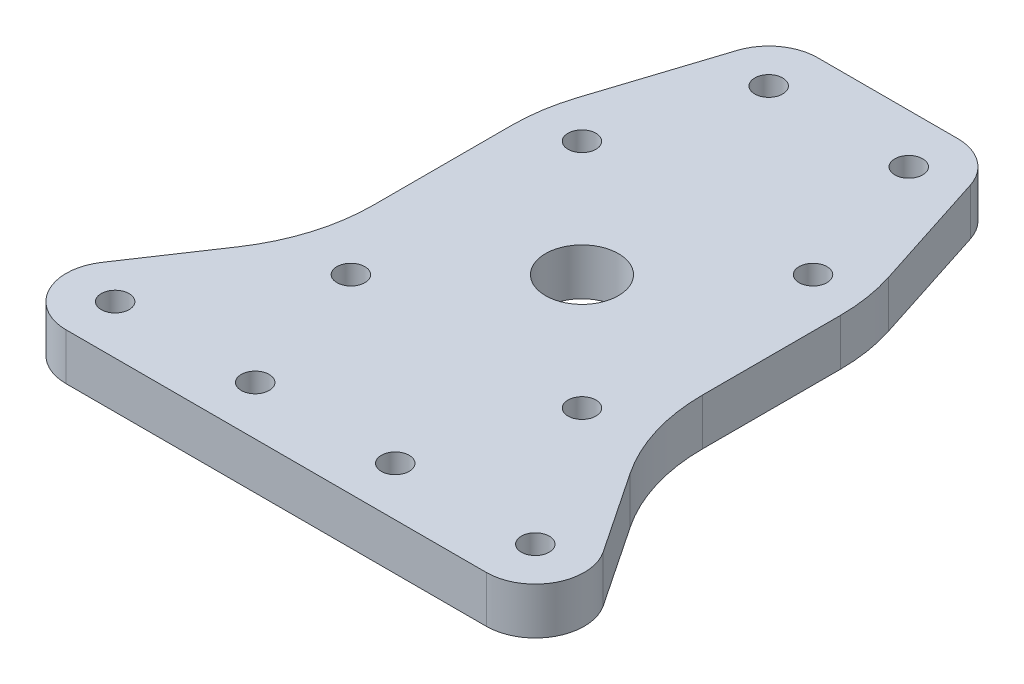
ISO-10303-21;
HEADER;
FILE_DESCRIPTION(('STEP AP214'),'2;1');
FILE_NAME('part.step','',(''),(''),'','','');
FILE_SCHEMA(('AUTOMOTIVE_DESIGN { 1 0 10303 214 1 1 1 1 }'));
ENDSEC;
DATA;
#1=APPLICATION_CONTEXT('core data for automotive mechanical design processes');
#2=APPLICATION_PROTOCOL_DEFINITION('international standard','automotive_design',2000,#1);
#3=PRODUCT_CONTEXT('',#1,'mechanical');
#4=PRODUCT('Part','Part','',(#3));
#5=PRODUCT_RELATED_PRODUCT_CATEGORY('part','',(#4));
#6=PRODUCT_DEFINITION_FORMATION('','',#4);
#7=PRODUCT_DEFINITION_CONTEXT('part definition',#1,'design');
#8=PRODUCT_DEFINITION('design','',#6,#7);
#9=PRODUCT_DEFINITION_SHAPE('','',#8);
#10=(LENGTH_UNIT() NAMED_UNIT(*) SI_UNIT(.MILLI.,.METRE.));
#11=(NAMED_UNIT(*) PLANE_ANGLE_UNIT() SI_UNIT($,.RADIAN.));
#12=(NAMED_UNIT(*) SI_UNIT($,.STERADIAN.) SOLID_ANGLE_UNIT());
#13=UNCERTAINTY_MEASURE_WITH_UNIT(LENGTH_MEASURE(1.E-05),#10,'distance_accuracy_value','');
#14=(GEOMETRIC_REPRESENTATION_CONTEXT(3) GLOBAL_UNCERTAINTY_ASSIGNED_CONTEXT((#13)) GLOBAL_UNIT_ASSIGNED_CONTEXT((#10,
#11,#12)) REPRESENTATION_CONTEXT('',''));
#15=CARTESIAN_POINT('',(0.,0.,0.));
#16=DIRECTION('',(0.,0.,1.));
#17=DIRECTION('',(1.,0.,0.));
#18=AXIS2_PLACEMENT_3D('',#15,#16,#17);
#19=CARTESIAN_POINT('',(0.,0.,0.));
#20=DIRECTION('',(0.,-1.,0.));
#21=DIRECTION('',(0.,0.,-1.));
#22=AXIS2_PLACEMENT_3D('',#19,#20,#21);
#23=PLANE('',#22);
#24=CARTESIAN_POINT('',(-15.7154482118709,0.,-60.1654482118711));
#25=DIRECTION('',(0.,1.,0.));
#26=DIRECTION('',(0.,0.,1.));
#27=AXIS2_PLACEMENT_3D('',#24,#25,#26);
#28=CIRCLE('',#27,1.89865);
#29=CARTESIAN_POINT('',(-15.7154482118709,0.,-58.2667982118711));
#30=VERTEX_POINT('',#29);
#31=EDGE_CURVE('E228',#30,#30,#28,.T.);
#32=ORIENTED_EDGE('',*,*,#31,.F.);
#33=EDGE_LOOP('',(#32));
#34=FACE_BOUND('',#33,.T.);
#35=CARTESIAN_POINT('',(15.7154482118709,0.,-28.7345517881289));
#36=DIRECTION('',(0.,1.,0.));
#37=DIRECTION('',(0.,0.,1.));
#38=AXIS2_PLACEMENT_3D('',#35,#36,#37);
#39=CIRCLE('',#38,1.89865);
#40=CARTESIAN_POINT('',(15.7154482118709,0.,-26.8359017881289));
#41=VERTEX_POINT('',#40);
#42=EDGE_CURVE('E246',#41,#41,#39,.T.);
#43=ORIENTED_EDGE('',*,*,#42,.F.);
#44=EDGE_LOOP('',(#43));
#45=FACE_BOUND('',#44,.T.);
#46=CARTESIAN_POINT('',(-15.7154482118712,0.,-28.7345517881291));
#47=DIRECTION('',(0.,1.,0.));
#48=DIRECTION('',(0.,0.,1.));
#49=AXIS2_PLACEMENT_3D('',#46,#47,#48);
#50=CIRCLE('',#49,1.89865);
#51=CARTESIAN_POINT('',(-15.7154482118712,0.,-26.8359017881291));
#52=VERTEX_POINT('',#51);
#53=EDGE_CURVE('E252',#52,#52,#50,.T.);
#54=ORIENTED_EDGE('',*,*,#53,.F.);
#55=EDGE_LOOP('',(#54));
#56=FACE_BOUND('',#55,.T.);
#57=CARTESIAN_POINT('',(-9.525,0.,-9.525));
#58=DIRECTION('',(0.,1.,0.));
#59=DIRECTION('',(0.,0.,1.));
#60=AXIS2_PLACEMENT_3D('',#57,#58,#59);
#61=CIRCLE('',#60,1.89864999999999);
#62=CARTESIAN_POINT('',(-9.525,0.,-7.62635000000001));
#63=VERTEX_POINT('',#62);
#64=EDGE_CURVE('E300',#63,#63,#61,.T.);
#65=ORIENTED_EDGE('',*,*,#64,.F.);
#66=EDGE_LOOP('',(#65));
#67=FACE_BOUND('',#66,.T.);
#68=CARTESIAN_POINT('',(-28.575,0.,-9.525));
#69=DIRECTION('',(0.,1.,0.));
#70=DIRECTION('',(0.,0.,1.));
#71=AXIS2_PLACEMENT_3D('',#68,#69,#70);
#72=CIRCLE('',#71,1.89864999999999);
#73=CARTESIAN_POINT('',(-28.575,0.,-7.62635000000001));
#74=VERTEX_POINT('',#73);
#75=EDGE_CURVE('E294',#74,#74,#72,.T.);
#76=ORIENTED_EDGE('',*,*,#75,.F.);
#77=EDGE_LOOP('',(#76));
#78=FACE_BOUND('',#77,.T.);
#79=CARTESIAN_POINT('',(9.525,0.,-79.375));
#80=DIRECTION('',(0.,1.,0.));
#81=DIRECTION('',(0.,0.,1.));
#82=AXIS2_PLACEMENT_3D('',#79,#80,#81);
#83=CIRCLE('',#82,1.89864999999999);
#84=CARTESIAN_POINT('',(9.525,0.,-77.47635));
#85=VERTEX_POINT('',#84);
#86=EDGE_CURVE('E288',#85,#85,#83,.T.);
#87=ORIENTED_EDGE('',*,*,#86,.F.);
#88=EDGE_LOOP('',(#87));
#89=FACE_BOUND('',#88,.T.);
#90=CARTESIAN_POINT('',(-9.525,0.,-79.375));
#91=DIRECTION('',(0.,1.,0.));
#92=DIRECTION('',(0.,0.,1.));
#93=AXIS2_PLACEMENT_3D('',#90,#91,#92);
#94=CIRCLE('',#93,1.89864999999999);
#95=CARTESIAN_POINT('',(-9.525,0.,-77.47635));
#96=VERTEX_POINT('',#95);
#97=EDGE_CURVE('E282',#96,#96,#94,.T.);
#98=ORIENTED_EDGE('',*,*,#97,.F.);
#99=EDGE_LOOP('',(#98));
#100=FACE_BOUND('',#99,.T.);
#101=CARTESIAN_POINT('',(9.525,0.,-9.525));
#102=DIRECTION('',(0.,1.,0.));
#103=DIRECTION('',(0.,0.,1.));
#104=AXIS2_PLACEMENT_3D('',#101,#102,#103);
#105=CIRCLE('',#104,1.89864999999999);
#106=CARTESIAN_POINT('',(9.525,0.,-7.62635000000001));
#107=VERTEX_POINT('',#106);
#108=EDGE_CURVE('E276',#107,#107,#105,.T.);
#109=ORIENTED_EDGE('',*,*,#108,.F.);
#110=EDGE_LOOP('',(#109));
#111=FACE_BOUND('',#110,.T.);
#112=CARTESIAN_POINT('',(28.575,0.,-9.525));
#113=DIRECTION('',(0.,1.,0.));
#114=DIRECTION('',(0.,0.,1.));
#115=AXIS2_PLACEMENT_3D('',#112,#113,#114);
#116=CIRCLE('',#115,1.89864999999999);
#117=CARTESIAN_POINT('',(28.575,0.,-7.62635000000001));
#118=VERTEX_POINT('',#117);
#119=EDGE_CURVE('E270',#118,#118,#116,.T.);
#120=ORIENTED_EDGE('',*,*,#119,.F.);
#121=EDGE_LOOP('',(#120));
#122=FACE_BOUND('',#121,.T.);
#123=CARTESIAN_POINT('',(0.,0.,-44.45));
#124=DIRECTION('',(0.,1.,0.));
#125=DIRECTION('',(0.,0.,1.));
#126=AXIS2_PLACEMENT_3D('',#123,#124,#125);
#127=CIRCLE('',#126,4.96062);
#128=CARTESIAN_POINT('',(0.,0.,-39.48938));
#129=VERTEX_POINT('',#128);
#130=EDGE_CURVE('E264',#129,#129,#127,.T.);
#131=ORIENTED_EDGE('',*,*,#130,.F.);
#132=EDGE_LOOP('',(#131));
#133=FACE_BOUND('',#132,.T.);
#134=CARTESIAN_POINT('',(15.7154482118712,0.,-60.1654482118709));
#135=DIRECTION('',(0.,1.,0.));
#136=DIRECTION('',(0.,0.,1.));
#137=AXIS2_PLACEMENT_3D('',#134,#135,#136);
#138=CIRCLE('',#137,1.89865);
#139=CARTESIAN_POINT('',(15.7154482118712,0.,-58.2667982118709));
#140=VERTEX_POINT('',#139);
#141=EDGE_CURVE('E258',#140,#140,#138,.T.);
#142=ORIENTED_EDGE('',*,*,#141,.F.);
#143=EDGE_LOOP('',(#142));
#144=FACE_BOUND('',#143,.T.);
#145=DIRECTION('',(-0.306725356798658,0.,0.951798064453136));
#146=VECTOR('',#145,1.);
#147=CARTESIAN_POINT('',(-38.1417386411364,0.,-12.2915131166457));
#148=LINE('',#147,#146);
#149=CARTESIAN_POINT('',(-15.865069677032,0.,-81.4181436104394));
#150=VERTEX_POINT('',#149);
#151=CARTESIAN_POINT('',(-21.1522690489806,0.,-65.0114592035097));
#152=VERTEX_POINT('',#151);
#153=EDGE_CURVE('E210',#150,#152,#148,.T.);
#154=ORIENTED_EDGE('',*,*,#153,.T.);
#155=CARTESIAN_POINT('',(3.02340178812909,0.,-57.2206351408238));
#156=DIRECTION('',(0.,-1.,0.));
#157=DIRECTION('',(0.,0.,-1.));
#158=AXIS2_PLACEMENT_3D('',#155,#156,#157);
#159=CIRCLE('',#158,25.4);
#160=CARTESIAN_POINT('',(-22.3765982118709,0.,-57.2206351408238));
#161=VERTEX_POINT('',#160);
#162=EDGE_CURVE('E311',#152,#161,#159,.F.);
#163=ORIENTED_EDGE('',*,*,#162,.T.);
#164=DIRECTION('',(0.,0.,1.));
#165=VECTOR('',#164,1.);
#166=CARTESIAN_POINT('',(-22.3765982118709,0.,0.));
#167=LINE('',#166,#165);
#168=CARTESIAN_POINT('',(-22.3765982118709,0.,-38.4753969646792));
#169=VERTEX_POINT('',#168);
#170=EDGE_CURVE('E207',#161,#169,#167,.T.);
#171=ORIENTED_EDGE('',*,*,#170,.T.);
#172=CARTESIAN_POINT('',(-47.7765982118709,0.,-38.4753969646792));
#173=DIRECTION('',(0.,-1.,0.));
#174=DIRECTION('',(0.,0.,-1.));
#175=AXIS2_PLACEMENT_3D('',#172,#173,#174);
#176=CIRCLE('',#175,25.4);
#177=CARTESIAN_POINT('',(-26.6695305790557,0.,-24.3455811150736));
#178=VERTEX_POINT('',#177);
#179=EDGE_CURVE('E42',#169,#178,#176,.T.);
#180=ORIENTED_EDGE('',*,*,#179,.T.);
#181=DIRECTION('',(-0.556291962582896,0.,0.830986914677764));
#182=VECTOR('',#181,1.);
#183=CARTESIAN_POINT('',(-29.6706221522406,0.,-19.8625614153333));
#184=LINE('',#183,#182);
#185=CARTESIAN_POINT('',(-34.1103284867058,0.,-13.2305442065591));
#186=VERTEX_POINT('',#185);
#187=EDGE_CURVE('E205',#178,#186,#184,.T.);
#188=ORIENTED_EDGE('',*,*,#187,.T.);
#189=CARTESIAN_POINT('',(-28.575,0.,-9.525));
#190=DIRECTION('',(0.,1.,0.));
#191=DIRECTION('',(0.,0.,1.));
#192=AXIS2_PLACEMENT_3D('',#189,#190,#191);
#193=CIRCLE('',#192,6.66114999999999);
#194=CARTESIAN_POINT('',(-28.575,0.,-2.86385000000002));
#195=VERTEX_POINT('',#194);
#196=EDGE_CURVE('E202',#186,#195,#193,.T.);
#197=ORIENTED_EDGE('',*,*,#196,.T.);
#198=DIRECTION('',(1.,0.,0.));
#199=VECTOR('',#198,1.);
#200=CARTESIAN_POINT('',(0.,0.,-2.86385000000002));
#201=LINE('',#200,#199);
#202=CARTESIAN_POINT('',(28.575,0.,-2.86385000000002));
#203=VERTEX_POINT('',#202);
#204=EDGE_CURVE('E200',#195,#203,#201,.T.);
#205=ORIENTED_EDGE('',*,*,#204,.T.);
#206=CARTESIAN_POINT('',(28.575,0.,-9.525));
#207=DIRECTION('',(0.,1.,0.));
#208=DIRECTION('',(0.,0.,1.));
#209=AXIS2_PLACEMENT_3D('',#206,#207,#208);
#210=CIRCLE('',#209,6.66114999999999);
#211=CARTESIAN_POINT('',(34.1103284867058,0.,-13.2305442065591));
#212=VERTEX_POINT('',#211);
#213=EDGE_CURVE('E167',#203,#212,#210,.T.);
#214=ORIENTED_EDGE('',*,*,#213,.T.);
#215=DIRECTION('',(0.556291962582896,0.,0.830986914677764));
#216=VECTOR('',#215,1.);
#217=CARTESIAN_POINT('',(29.6706221522406,0.,-19.8625614153334));
#218=LINE('',#217,#216);
#219=CARTESIAN_POINT('',(26.6695305790559,0.,-24.3455811150733));
#220=VERTEX_POINT('',#219);
#221=EDGE_CURVE('E173',#220,#212,#218,.T.);
#222=ORIENTED_EDGE('',*,*,#221,.F.);
#223=CARTESIAN_POINT('',(47.7765982118712,0.,-38.4753969646789));
#224=DIRECTION('',(0.,-1.,0.));
#225=DIRECTION('',(0.,0.,-1.));
#226=AXIS2_PLACEMENT_3D('',#223,#224,#225);
#227=CIRCLE('',#226,25.4);
#228=CARTESIAN_POINT('',(22.3765982118712,0.,-38.4753969646789));
#229=VERTEX_POINT('',#228);
#230=EDGE_CURVE('E332',#220,#229,#227,.T.);
#231=ORIENTED_EDGE('',*,*,#230,.T.);
#232=DIRECTION('',(0.,0.,1.));
#233=VECTOR('',#232,1.);
#234=CARTESIAN_POINT('',(22.3765982118712,0.,0.));
#235=LINE('',#234,#233);
#236=CARTESIAN_POINT('',(22.3765982118711,0.,-57.2206351408231));
#237=VERTEX_POINT('',#236);
#238=EDGE_CURVE('E175',#237,#229,#235,.T.);
#239=ORIENTED_EDGE('',*,*,#238,.F.);
#240=CARTESIAN_POINT('',(-3.02340178812886,0.,-57.2206351408231));
#241=DIRECTION('',(0.,-1.,0.));
#242=DIRECTION('',(0.,0.,-1.));
#243=AXIS2_PLACEMENT_3D('',#240,#241,#242);
#244=CIRCLE('',#243,25.4);
#245=CARTESIAN_POINT('',(21.1522690489808,0.,-65.011459203509));
#246=VERTEX_POINT('',#245);
#247=EDGE_CURVE('E309',#237,#246,#244,.F.);
#248=ORIENTED_EDGE('',*,*,#247,.T.);
#249=DIRECTION('',(0.306725356798657,0.,0.951798064453136));
#250=VECTOR('',#249,1.);
#251=CARTESIAN_POINT('',(38.1417386411364,0.,-12.2915131166457));
#252=LINE('',#251,#250);
#253=CARTESIAN_POINT('',(15.865069677032,0.,-81.4181436104394));
#254=VERTEX_POINT('',#253);
#255=EDGE_CURVE('E222',#254,#246,#252,.T.);
#256=ORIENTED_EDGE('',*,*,#255,.F.);
#257=CARTESIAN_POINT('',(9.525,0.,-79.375));
#258=DIRECTION('',(0.,1.,0.));
#259=DIRECTION('',(0.,0.,1.));
#260=AXIS2_PLACEMENT_3D('',#257,#258,#259);
#261=CIRCLE('',#260,6.66114999999999);
#262=CARTESIAN_POINT('',(9.525,0.,-86.03615));
#263=VERTEX_POINT('',#262);
#264=EDGE_CURVE('E219',#254,#263,#261,.T.);
#265=ORIENTED_EDGE('',*,*,#264,.T.);
#266=DIRECTION('',(1.,0.,0.));
#267=VECTOR('',#266,1.);
#268=CARTESIAN_POINT('',(0.,0.,-86.03615));
#269=LINE('',#268,#267);
#270=CARTESIAN_POINT('',(-9.525,0.,-86.03615));
#271=VERTEX_POINT('',#270);
#272=EDGE_CURVE('E216',#271,#263,#269,.T.);
#273=ORIENTED_EDGE('',*,*,#272,.F.);
#274=CARTESIAN_POINT('',(-9.525,0.,-79.375));
#275=DIRECTION('',(0.,1.,0.));
#276=DIRECTION('',(0.,0.,1.));
#277=AXIS2_PLACEMENT_3D('',#274,#275,#276);
#278=CIRCLE('',#277,6.66114999999999);
#279=EDGE_CURVE('E213',#271,#150,#278,.T.);
#280=ORIENTED_EDGE('',*,*,#279,.T.);
#281=EDGE_LOOP('',(#154,#163,#171,#180,#188,#197,#205,#214,#222,#231,#239,#248,#256,#265,#273,#280));
#282=FACE_BOUND('',#281,.T.);
#283=ADVANCED_FACE('F34',(#34,#45,#56,#67,#78,#89,#100,#111,#122,#133,#144,#282),#23,.F.);
#284=CARTESIAN_POINT('',(0.,-6.35,0.));
#285=DIRECTION('',(0.,-1.,0.));
#286=DIRECTION('',(0.,0.,-1.));
#287=AXIS2_PLACEMENT_3D('',#284,#285,#286);
#288=PLANE('',#287);
#289=CARTESIAN_POINT('',(-9.525,-6.34999999999999,-9.525));
#290=DIRECTION('',(0.,1.,0.));
#291=DIRECTION('',(0.,0.,1.));
#292=AXIS2_PLACEMENT_3D('',#289,#290,#291);
#293=CIRCLE('',#292,1.89864999999999);
#294=CARTESIAN_POINT('',(-9.525,-6.34999999999999,-7.62635000000001));
#295=VERTEX_POINT('',#294);
#296=EDGE_CURVE('E303',#295,#295,#293,.T.);
#297=ORIENTED_EDGE('',*,*,#296,.T.);
#298=EDGE_LOOP('',(#297));
#299=FACE_BOUND('',#298,.T.);
#300=CARTESIAN_POINT('',(-28.575,-6.34999999999999,-9.525));
#301=DIRECTION('',(0.,1.,0.));
#302=DIRECTION('',(0.,0.,1.));
#303=AXIS2_PLACEMENT_3D('',#300,#301,#302);
#304=CIRCLE('',#303,1.89864999999999);
#305=CARTESIAN_POINT('',(-28.575,-6.34999999999999,-7.62635000000001));
#306=VERTEX_POINT('',#305);
#307=EDGE_CURVE('E297',#306,#306,#304,.T.);
#308=ORIENTED_EDGE('',*,*,#307,.T.);
#309=EDGE_LOOP('',(#308));
#310=FACE_BOUND('',#309,.T.);
#311=CARTESIAN_POINT('',(9.525,-6.34999999999999,-79.375));
#312=DIRECTION('',(0.,1.,0.));
#313=DIRECTION('',(0.,0.,1.));
#314=AXIS2_PLACEMENT_3D('',#311,#312,#313);
#315=CIRCLE('',#314,1.89864999999999);
#316=CARTESIAN_POINT('',(9.525,-6.34999999999999,-77.47635));
#317=VERTEX_POINT('',#316);
#318=EDGE_CURVE('E291',#317,#317,#315,.T.);
#319=ORIENTED_EDGE('',*,*,#318,.T.);
#320=EDGE_LOOP('',(#319));
#321=FACE_BOUND('',#320,.T.);
#322=CARTESIAN_POINT('',(-9.525,-6.34999999999999,-79.375));
#323=DIRECTION('',(0.,1.,0.));
#324=DIRECTION('',(0.,0.,1.));
#325=AXIS2_PLACEMENT_3D('',#322,#323,#324);
#326=CIRCLE('',#325,1.89864999999999);
#327=CARTESIAN_POINT('',(-9.525,-6.34999999999999,-77.47635));
#328=VERTEX_POINT('',#327);
#329=EDGE_CURVE('E285',#328,#328,#326,.T.);
#330=ORIENTED_EDGE('',*,*,#329,.T.);
#331=EDGE_LOOP('',(#330));
#332=FACE_BOUND('',#331,.T.);
#333=CARTESIAN_POINT('',(9.525,-6.34999999999999,-9.525));
#334=DIRECTION('',(0.,1.,0.));
#335=DIRECTION('',(0.,0.,1.));
#336=AXIS2_PLACEMENT_3D('',#333,#334,#335);
#337=CIRCLE('',#336,1.89864999999999);
#338=CARTESIAN_POINT('',(9.525,-6.34999999999999,-7.62635000000001));
#339=VERTEX_POINT('',#338);
#340=EDGE_CURVE('E279',#339,#339,#337,.T.);
#341=ORIENTED_EDGE('',*,*,#340,.T.);
#342=EDGE_LOOP('',(#341));
#343=FACE_BOUND('',#342,.T.);
#344=CARTESIAN_POINT('',(28.575,-6.34999999999999,-9.525));
#345=DIRECTION('',(0.,1.,0.));
#346=DIRECTION('',(0.,0.,1.));
#347=AXIS2_PLACEMENT_3D('',#344,#345,#346);
#348=CIRCLE('',#347,1.89864999999999);
#349=CARTESIAN_POINT('',(28.575,-6.34999999999999,-7.62635000000001));
#350=VERTEX_POINT('',#349);
#351=EDGE_CURVE('E273',#350,#350,#348,.T.);
#352=ORIENTED_EDGE('',*,*,#351,.T.);
#353=EDGE_LOOP('',(#352));
#354=FACE_BOUND('',#353,.T.);
#355=CARTESIAN_POINT('',(0.,-6.35,-44.45));
#356=DIRECTION('',(0.,1.,0.));
#357=DIRECTION('',(0.,0.,1.));
#358=AXIS2_PLACEMENT_3D('',#355,#356,#357);
#359=CIRCLE('',#358,4.96062);
#360=CARTESIAN_POINT('',(0.,-6.35,-39.48938));
#361=VERTEX_POINT('',#360);
#362=EDGE_CURVE('E267',#361,#361,#359,.T.);
#363=ORIENTED_EDGE('',*,*,#362,.T.);
#364=EDGE_LOOP('',(#363));
#365=FACE_BOUND('',#364,.T.);
#366=CARTESIAN_POINT('',(15.7154482118712,-6.35,-60.1654482118709));
#367=DIRECTION('',(0.,-1.,0.));
#368=DIRECTION('',(0.,0.,-1.));
#369=AXIS2_PLACEMENT_3D('',#366,#367,#368);
#370=CIRCLE('',#369,1.89865);
#371=CARTESIAN_POINT('',(15.7154482118712,-6.35,-62.0640982118709));
#372=VERTEX_POINT('',#371);
#373=EDGE_CURVE('E261',#372,#372,#370,.T.);
#374=ORIENTED_EDGE('',*,*,#373,.F.);
#375=EDGE_LOOP('',(#374));
#376=FACE_BOUND('',#375,.T.);
#377=CARTESIAN_POINT('',(-15.7154482118712,-6.35,-28.7345517881291));
#378=DIRECTION('',(0.,-1.,0.));
#379=DIRECTION('',(0.,0.,-1.));
#380=AXIS2_PLACEMENT_3D('',#377,#378,#379);
#381=CIRCLE('',#380,1.89865);
#382=CARTESIAN_POINT('',(-15.7154482118712,-6.35,-30.6332017881291));
#383=VERTEX_POINT('',#382);
#384=EDGE_CURVE('E255',#383,#383,#381,.T.);
#385=ORIENTED_EDGE('',*,*,#384,.F.);
#386=EDGE_LOOP('',(#385));
#387=FACE_BOUND('',#386,.T.);
#388=CARTESIAN_POINT('',(15.7154482118709,-6.35,-28.7345517881289));
#389=DIRECTION('',(0.,-1.,0.));
#390=DIRECTION('',(0.,0.,-1.));
#391=AXIS2_PLACEMENT_3D('',#388,#389,#390);
#392=CIRCLE('',#391,1.89865);
#393=CARTESIAN_POINT('',(15.7154482118709,-6.35,-30.6332017881289));
#394=VERTEX_POINT('',#393);
#395=EDGE_CURVE('E249',#394,#394,#392,.T.);
#396=ORIENTED_EDGE('',*,*,#395,.F.);
#397=EDGE_LOOP('',(#396));
#398=FACE_BOUND('',#397,.T.);
#399=CARTESIAN_POINT('',(-15.7154482118709,-6.35,-60.1654482118711));
#400=DIRECTION('',(0.,-1.,0.));
#401=DIRECTION('',(0.,0.,-1.));
#402=AXIS2_PLACEMENT_3D('',#399,#400,#401);
#403=CIRCLE('',#402,1.89865);
#404=CARTESIAN_POINT('',(-15.7154482118709,-6.35,-62.0640982118711));
#405=VERTEX_POINT('',#404);
#406=EDGE_CURVE('E243',#405,#405,#403,.T.);
#407=ORIENTED_EDGE('',*,*,#406,.F.);
#408=EDGE_LOOP('',(#407));
#409=FACE_BOUND('',#408,.T.);
#410=DIRECTION('',(0.,0.,1.));
#411=VECTOR('',#410,1.);
#412=CARTESIAN_POINT('',(-22.3765982118709,-6.35,0.));
#413=LINE('',#412,#411);
#414=CARTESIAN_POINT('',(-22.3765982118709,-6.35,-57.2206351408238));
#415=VERTEX_POINT('',#414);
#416=CARTESIAN_POINT('',(-22.3765982118709,-6.35,-38.4753969646792));
#417=VERTEX_POINT('',#416);
#418=EDGE_CURVE('E181',#415,#417,#413,.T.);
#419=ORIENTED_EDGE('',*,*,#418,.F.);
#420=CARTESIAN_POINT('',(3.02340178812909,-6.35,-57.2206351408238));
#421=DIRECTION('',(0.,-1.,0.));
#422=DIRECTION('',(0.,0.,-1.));
#423=AXIS2_PLACEMENT_3D('',#420,#421,#422);
#424=CIRCLE('',#423,25.4);
#425=CARTESIAN_POINT('',(-21.1522690489806,-6.35,-65.0114592035097));
#426=VERTEX_POINT('',#425);
#427=EDGE_CURVE('E319',#415,#426,#424,.T.);
#428=ORIENTED_EDGE('',*,*,#427,.T.);
#429=DIRECTION('',(-0.306725356798658,0.,0.951798064453136));
#430=VECTOR('',#429,1.);
#431=CARTESIAN_POINT('',(-38.1417386411364,-6.35,-12.2915131166457));
#432=LINE('',#431,#430);
#433=CARTESIAN_POINT('',(-15.865069677032,-6.35,-81.4181436104394));
#434=VERTEX_POINT('',#433);
#435=EDGE_CURVE('E184',#434,#426,#432,.T.);
#436=ORIENTED_EDGE('',*,*,#435,.F.);
#437=CARTESIAN_POINT('',(-9.525,-6.35,-79.375));
#438=DIRECTION('',(0.,1.,0.));
#439=DIRECTION('',(0.,0.,1.));
#440=AXIS2_PLACEMENT_3D('',#437,#438,#439);
#441=CIRCLE('',#440,6.66114999999999);
#442=CARTESIAN_POINT('',(-9.525,-6.35,-86.03615));
#443=VERTEX_POINT('',#442);
#444=EDGE_CURVE('E187',#443,#434,#441,.T.);
#445=ORIENTED_EDGE('',*,*,#444,.F.);
#446=DIRECTION('',(1.,0.,0.));
#447=VECTOR('',#446,1.);
#448=CARTESIAN_POINT('',(0.,-6.35,-86.03615));
#449=LINE('',#448,#447);
#450=CARTESIAN_POINT('',(9.525,-6.35,-86.03615));
#451=VERTEX_POINT('',#450);
#452=EDGE_CURVE('E189',#443,#451,#449,.T.);
#453=ORIENTED_EDGE('',*,*,#452,.T.);
#454=CARTESIAN_POINT('',(9.525,-6.35,-79.375));
#455=DIRECTION('',(0.,1.,0.));
#456=DIRECTION('',(0.,0.,1.));
#457=AXIS2_PLACEMENT_3D('',#454,#455,#456);
#458=CIRCLE('',#457,6.66114999999999);
#459=CARTESIAN_POINT('',(15.865069677032,-6.35,-81.4181436104394));
#460=VERTEX_POINT('',#459);
#461=EDGE_CURVE('E192',#460,#451,#458,.T.);
#462=ORIENTED_EDGE('',*,*,#461,.F.);
#463=DIRECTION('',(0.306725356798657,0.,0.951798064453136));
#464=VECTOR('',#463,1.);
#465=CARTESIAN_POINT('',(38.1417386411364,-6.35,-12.2915131166457));
#466=LINE('',#465,#464);
#467=CARTESIAN_POINT('',(21.1522690489808,-6.35,-65.011459203509));
#468=VERTEX_POINT('',#467);
#469=EDGE_CURVE('E194',#460,#468,#466,.T.);
#470=ORIENTED_EDGE('',*,*,#469,.T.);
#471=CARTESIAN_POINT('',(-3.02340178812886,-6.35,-57.2206351408231));
#472=DIRECTION('',(0.,-1.,0.));
#473=DIRECTION('',(0.,0.,-1.));
#474=AXIS2_PLACEMENT_3D('',#471,#472,#473);
#475=CIRCLE('',#474,25.4);
#476=CARTESIAN_POINT('',(22.3765982118711,-6.35,-57.2206351408231));
#477=VERTEX_POINT('',#476);
#478=EDGE_CURVE('E56',#468,#477,#475,.T.);
#479=ORIENTED_EDGE('',*,*,#478,.T.);
#480=DIRECTION('',(0.,0.,1.));
#481=VECTOR('',#480,1.);
#482=CARTESIAN_POINT('',(22.3765982118712,-6.35,0.));
#483=LINE('',#482,#481);
#484=CARTESIAN_POINT('',(22.3765982118712,-6.35,-38.4753969646789));
#485=VERTEX_POINT('',#484);
#486=EDGE_CURVE('E196',#477,#485,#483,.T.);
#487=ORIENTED_EDGE('',*,*,#486,.T.);
#488=CARTESIAN_POINT('',(47.7765982118712,-6.35,-38.4753969646789));
#489=DIRECTION('',(0.,-1.,0.));
#490=DIRECTION('',(0.,0.,-1.));
#491=AXIS2_PLACEMENT_3D('',#488,#489,#490);
#492=CIRCLE('',#491,25.4);
#493=CARTESIAN_POINT('',(26.6695305790559,-6.35,-24.3455811150733));
#494=VERTEX_POINT('',#493);
#495=EDGE_CURVE('E334',#485,#494,#492,.F.);
#496=ORIENTED_EDGE('',*,*,#495,.T.);
#497=DIRECTION('',(0.556291962582896,0.,0.830986914677764));
#498=VECTOR('',#497,1.);
#499=CARTESIAN_POINT('',(29.6706221522406,-6.35,-19.8625614153334));
#500=LINE('',#499,#498);
#501=CARTESIAN_POINT('',(34.1103284867058,-6.35,-13.2305442065591));
#502=VERTEX_POINT('',#501);
#503=EDGE_CURVE('E168',#494,#502,#500,.T.);
#504=ORIENTED_EDGE('',*,*,#503,.T.);
#505=CARTESIAN_POINT('',(28.575,-6.35,-9.525));
#506=DIRECTION('',(0.,1.,0.));
#507=DIRECTION('',(0.,0.,1.));
#508=AXIS2_PLACEMENT_3D('',#505,#506,#507);
#509=CIRCLE('',#508,6.66114999999999);
#510=CARTESIAN_POINT('',(28.575,-6.35,-2.86385000000002));
#511=VERTEX_POINT('',#510);
#512=EDGE_CURVE('E159',#511,#502,#509,.T.);
#513=ORIENTED_EDGE('',*,*,#512,.F.);
#514=DIRECTION('',(1.,0.,0.));
#515=VECTOR('',#514,1.);
#516=CARTESIAN_POINT('',(0.,-6.35,-2.86385000000002));
#517=LINE('',#516,#515);
#518=CARTESIAN_POINT('',(-28.575,-6.35,-2.86385000000002));
#519=VERTEX_POINT('',#518);
#520=EDGE_CURVE('E148',#519,#511,#517,.T.);
#521=ORIENTED_EDGE('',*,*,#520,.F.);
#522=CARTESIAN_POINT('',(-28.575,-6.35,-9.525));
#523=DIRECTION('',(0.,1.,0.));
#524=DIRECTION('',(0.,0.,1.));
#525=AXIS2_PLACEMENT_3D('',#522,#523,#524);
#526=CIRCLE('',#525,6.66114999999999);
#527=CARTESIAN_POINT('',(-34.1103284867058,-6.35,-13.2305442065591));
#528=VERTEX_POINT('',#527);
#529=EDGE_CURVE('E158',#528,#519,#526,.T.);
#530=ORIENTED_EDGE('',*,*,#529,.F.);
#531=DIRECTION('',(-0.556291962582896,0.,0.830986914677764));
#532=VECTOR('',#531,1.);
#533=CARTESIAN_POINT('',(-29.6706221522406,-6.35,-19.8625614153333));
#534=LINE('',#533,#532);
#535=CARTESIAN_POINT('',(-26.6695305790557,-6.35,-24.3455811150736));
#536=VERTEX_POINT('',#535);
#537=EDGE_CURVE('E179',#536,#528,#534,.T.);
#538=ORIENTED_EDGE('',*,*,#537,.F.);
#539=CARTESIAN_POINT('',(-47.7765982118709,-6.35,-38.4753969646792));
#540=DIRECTION('',(0.,-1.,0.));
#541=DIRECTION('',(0.,0.,-1.));
#542=AXIS2_PLACEMENT_3D('',#539,#540,#541);
#543=CIRCLE('',#542,25.4);
#544=EDGE_CURVE('E11',#536,#417,#543,.F.);
#545=ORIENTED_EDGE('',*,*,#544,.T.);
#546=EDGE_LOOP('',(#419,#428,#436,#445,#453,#462,#470,#479,#487,#496,#504,#513,#521,#530,#538,#545));
#547=FACE_BOUND('',#546,.T.);
#548=ADVANCED_FACE('F171',(#299,#310,#321,#332,#343,#354,#365,#376,#387,#398,#409,#547),#288,.T.);
#549=CARTESIAN_POINT('',(-9.525,0.,-9.525));
#550=DIRECTION('',(0.,1.,0.));
#551=DIRECTION('',(0.,0.,1.));
#552=AXIS2_PLACEMENT_3D('',#549,#550,#551);
#553=CYLINDRICAL_SURFACE('',#552,1.89864999999999);
#554=ORIENTED_EDGE('',*,*,#296,.F.);
#555=EDGE_LOOP('',(#554));
#556=FACE_BOUND('',#555,.T.);
#557=ORIENTED_EDGE('',*,*,#64,.T.);
#558=EDGE_LOOP('',(#557));
#559=FACE_BOUND('',#558,.T.);
#560=ADVANCED_FACE('F405',(#556,#559),#553,.F.);
#561=CARTESIAN_POINT('',(-28.575,0.,-9.525));
#562=DIRECTION('',(0.,1.,0.));
#563=DIRECTION('',(0.,0.,1.));
#564=AXIS2_PLACEMENT_3D('',#561,#562,#563);
#565=CYLINDRICAL_SURFACE('',#564,1.89864999999999);
#566=ORIENTED_EDGE('',*,*,#307,.F.);
#567=EDGE_LOOP('',(#566));
#568=FACE_BOUND('',#567,.T.);
#569=ORIENTED_EDGE('',*,*,#75,.T.);
#570=EDGE_LOOP('',(#569));
#571=FACE_BOUND('',#570,.T.);
#572=ADVANCED_FACE('F627',(#568,#571),#565,.F.);
#573=CARTESIAN_POINT('',(9.525,0.,-79.375));
#574=DIRECTION('',(0.,1.,0.));
#575=DIRECTION('',(0.,0.,1.));
#576=AXIS2_PLACEMENT_3D('',#573,#574,#575);
#577=CYLINDRICAL_SURFACE('',#576,1.89864999999999);
#578=ORIENTED_EDGE('',*,*,#318,.F.);
#579=EDGE_LOOP('',(#578));
#580=FACE_BOUND('',#579,.T.);
#581=ORIENTED_EDGE('',*,*,#86,.T.);
#582=EDGE_LOOP('',(#581));
#583=FACE_BOUND('',#582,.T.);
#584=ADVANCED_FACE('F617',(#580,#583),#577,.F.);
#585=CARTESIAN_POINT('',(-9.525,0.,-79.375));
#586=DIRECTION('',(0.,1.,0.));
#587=DIRECTION('',(0.,0.,1.));
#588=AXIS2_PLACEMENT_3D('',#585,#586,#587);
#589=CYLINDRICAL_SURFACE('',#588,1.89864999999999);
#590=ORIENTED_EDGE('',*,*,#329,.F.);
#591=EDGE_LOOP('',(#590));
#592=FACE_BOUND('',#591,.T.);
#593=ORIENTED_EDGE('',*,*,#97,.T.);
#594=EDGE_LOOP('',(#593));
#595=FACE_BOUND('',#594,.T.);
#596=ADVANCED_FACE('F607',(#592,#595),#589,.F.);
#597=CARTESIAN_POINT('',(9.525,0.,-9.525));
#598=DIRECTION('',(0.,1.,0.));
#599=DIRECTION('',(0.,0.,1.));
#600=AXIS2_PLACEMENT_3D('',#597,#598,#599);
#601=CYLINDRICAL_SURFACE('',#600,1.89864999999999);
#602=ORIENTED_EDGE('',*,*,#340,.F.);
#603=EDGE_LOOP('',(#602));
#604=FACE_BOUND('',#603,.T.);
#605=ORIENTED_EDGE('',*,*,#108,.T.);
#606=EDGE_LOOP('',(#605));
#607=FACE_BOUND('',#606,.T.);
#608=ADVANCED_FACE('F597',(#604,#607),#601,.F.);
#609=CARTESIAN_POINT('',(28.575,0.,-9.525));
#610=DIRECTION('',(0.,1.,0.));
#611=DIRECTION('',(0.,0.,1.));
#612=AXIS2_PLACEMENT_3D('',#609,#610,#611);
#613=CYLINDRICAL_SURFACE('',#612,1.89864999999999);
#614=ORIENTED_EDGE('',*,*,#351,.F.);
#615=EDGE_LOOP('',(#614));
#616=FACE_BOUND('',#615,.T.);
#617=ORIENTED_EDGE('',*,*,#119,.T.);
#618=EDGE_LOOP('',(#617));
#619=FACE_BOUND('',#618,.T.);
#620=ADVANCED_FACE('F587',(#616,#619),#613,.F.);
#621=CARTESIAN_POINT('',(0.,0.,-44.45));
#622=DIRECTION('',(0.,1.,0.));
#623=DIRECTION('',(0.,0.,1.));
#624=AXIS2_PLACEMENT_3D('',#621,#622,#623);
#625=CYLINDRICAL_SURFACE('',#624,4.96062);
#626=ORIENTED_EDGE('',*,*,#362,.F.);
#627=EDGE_LOOP('',(#626));
#628=FACE_BOUND('',#627,.T.);
#629=ORIENTED_EDGE('',*,*,#130,.T.);
#630=EDGE_LOOP('',(#629));
#631=FACE_BOUND('',#630,.T.);
#632=ADVANCED_FACE('F577',(#628,#631),#625,.F.);
#633=CARTESIAN_POINT('',(15.7154482118712,0.,-60.1654482118709));
#634=DIRECTION('',(0.,1.,0.));
#635=DIRECTION('',(0.,0.,1.));
#636=AXIS2_PLACEMENT_3D('',#633,#634,#635);
#637=CYLINDRICAL_SURFACE('',#636,1.89865);
#638=ORIENTED_EDGE('',*,*,#141,.T.);
#639=EDGE_LOOP('',(#638));
#640=FACE_BOUND('',#639,.T.);
#641=ORIENTED_EDGE('',*,*,#373,.T.);
#642=EDGE_LOOP('',(#641));
#643=FACE_BOUND('',#642,.T.);
#644=ADVANCED_FACE('F567',(#640,#643),#637,.F.);
#645=CARTESIAN_POINT('',(-15.7154482118712,0.,-28.7345517881291));
#646=DIRECTION('',(0.,1.,0.));
#647=DIRECTION('',(0.,0.,1.));
#648=AXIS2_PLACEMENT_3D('',#645,#646,#647);
#649=CYLINDRICAL_SURFACE('',#648,1.89865);
#650=ORIENTED_EDGE('',*,*,#53,.T.);
#651=EDGE_LOOP('',(#650));
#652=FACE_BOUND('',#651,.T.);
#653=ORIENTED_EDGE('',*,*,#384,.T.);
#654=EDGE_LOOP('',(#653));
#655=FACE_BOUND('',#654,.T.);
#656=ADVANCED_FACE('F557',(#652,#655),#649,.F.);
#657=CARTESIAN_POINT('',(15.7154482118709,0.,-28.7345517881289));
#658=DIRECTION('',(0.,1.,0.));
#659=DIRECTION('',(0.,0.,1.));
#660=AXIS2_PLACEMENT_3D('',#657,#658,#659);
#661=CYLINDRICAL_SURFACE('',#660,1.89865);
#662=ORIENTED_EDGE('',*,*,#42,.T.);
#663=EDGE_LOOP('',(#662));
#664=FACE_BOUND('',#663,.T.);
#665=ORIENTED_EDGE('',*,*,#395,.T.);
#666=EDGE_LOOP('',(#665));
#667=FACE_BOUND('',#666,.T.);
#668=ADVANCED_FACE('F547',(#664,#667),#661,.F.);
#669=CARTESIAN_POINT('',(-15.7154482118709,0.,-60.1654482118711));
#670=DIRECTION('',(0.,1.,0.));
#671=DIRECTION('',(0.,0.,1.));
#672=AXIS2_PLACEMENT_3D('',#669,#670,#671);
#673=CYLINDRICAL_SURFACE('',#672,1.89865);
#674=ORIENTED_EDGE('',*,*,#31,.T.);
#675=EDGE_LOOP('',(#674));
#676=FACE_BOUND('',#675,.T.);
#677=ORIENTED_EDGE('',*,*,#406,.T.);
#678=EDGE_LOOP('',(#677));
#679=FACE_BOUND('',#678,.T.);
#680=ADVANCED_FACE('F539',(#676,#679),#673,.F.);
#681=CARTESIAN_POINT('',(28.575,-6.35,-9.525));
#682=DIRECTION('',(0.,1.,0.));
#683=DIRECTION('',(0.,0.,1.));
#684=AXIS2_PLACEMENT_3D('',#681,#682,#683);
#685=CYLINDRICAL_SURFACE('',#684,6.66114999999999);
#686=ORIENTED_EDGE('',*,*,#213,.F.);
#687=DIRECTION('',(0.,1.,0.));
#688=VECTOR('',#687,1.);
#689=CARTESIAN_POINT('',(28.575,-6.35,-2.86385000000002));
#690=LINE('',#689,#688);
#691=EDGE_CURVE('E152',#511,#203,#690,.T.);
#692=ORIENTED_EDGE('',*,*,#691,.F.);
#693=ORIENTED_EDGE('',*,*,#512,.T.);
#694=DIRECTION('',(0.,1.,0.));
#695=VECTOR('',#694,1.);
#696=CARTESIAN_POINT('',(34.1103284867058,-6.35,-13.2305442065591));
#697=LINE('',#696,#695);
#698=EDGE_CURVE('E226',#502,#212,#697,.T.);
#699=ORIENTED_EDGE('',*,*,#698,.T.);
#700=EDGE_LOOP('',(#686,#692,#693,#699));
#701=FACE_BOUND('',#700,.T.);
#702=ADVANCED_FACE('F163',(#701),#685,.T.);
#703=CARTESIAN_POINT('',(29.6706221522406,-6.35,-19.8625614153334));
#704=DIRECTION('',(-0.830986914677764,0.,0.556291962582896));
#705=DIRECTION('',(0.556291962582896,0.,0.830986914677764));
#706=AXIS2_PLACEMENT_3D('',#703,#704,#705);
#707=PLANE('',#706);
#708=ORIENTED_EDGE('',*,*,#503,.F.);
#709=DIRECTION('',(0.,1.,0.));
#710=VECTOR('',#709,1.);
#711=CARTESIAN_POINT('',(26.6695305790559,0.,-24.3455811150733));
#712=LINE('',#711,#710);
#713=EDGE_CURVE('E327',#494,#220,#712,.T.);
#714=ORIENTED_EDGE('',*,*,#713,.T.);
#715=ORIENTED_EDGE('',*,*,#221,.T.);
#716=ORIENTED_EDGE('',*,*,#698,.F.);
#717=EDGE_LOOP('',(#708,#714,#715,#716));
#718=FACE_BOUND('',#717,.T.);
#719=ADVANCED_FACE('F388',(#718),#707,.F.);
#720=CARTESIAN_POINT('',(22.3765982118712,-6.35,0.));
#721=DIRECTION('',(-1.,0.,0.));
#722=DIRECTION('',(0.,0.,1.));
#723=AXIS2_PLACEMENT_3D('',#720,#721,#722);
#724=PLANE('',#723);
#725=ORIENTED_EDGE('',*,*,#486,.F.);
#726=DIRECTION('',(0.,1.,0.));
#727=VECTOR('',#726,1.);
#728=CARTESIAN_POINT('',(22.3765982118711,-6.35,-57.2206351408231));
#729=LINE('',#728,#727);
#730=EDGE_CURVE('E322',#477,#237,#729,.T.);
#731=ORIENTED_EDGE('',*,*,#730,.T.);
#732=ORIENTED_EDGE('',*,*,#238,.T.);
#733=DIRECTION('',(0.,1.,0.));
#734=VECTOR('',#733,1.);
#735=CARTESIAN_POINT('',(22.3765982118712,-6.35,-38.4753969646789));
#736=LINE('',#735,#734);
#737=EDGE_CURVE('E49',#229,#485,#736,.F.);
#738=ORIENTED_EDGE('',*,*,#737,.T.);
#739=EDGE_LOOP('',(#725,#731,#732,#738));
#740=FACE_BOUND('',#739,.T.);
#741=ADVANCED_FACE('F381',(#740),#724,.F.);
#742=CARTESIAN_POINT('',(38.1417386411364,-6.35,-12.2915131166457));
#743=DIRECTION('',(-0.951798064453136,0.,0.306725356798657));
#744=DIRECTION('',(0.306725356798657,0.,0.951798064453136));
#745=AXIS2_PLACEMENT_3D('',#742,#743,#744);
#746=PLANE('',#745);
#747=ORIENTED_EDGE('',*,*,#255,.T.);
#748=DIRECTION('',(0.,1.,0.));
#749=VECTOR('',#748,1.);
#750=CARTESIAN_POINT('',(21.1522690489808,-6.35,-65.011459203509));
#751=LINE('',#750,#749);
#752=EDGE_CURVE('E325',#246,#468,#751,.F.);
#753=ORIENTED_EDGE('',*,*,#752,.T.);
#754=ORIENTED_EDGE('',*,*,#469,.F.);
#755=DIRECTION('',(0.,1.,0.));
#756=VECTOR('',#755,1.);
#757=CARTESIAN_POINT('',(15.865069677032,-6.35,-81.4181436104394));
#758=LINE('',#757,#756);
#759=EDGE_CURVE('E229',#460,#254,#758,.T.);
#760=ORIENTED_EDGE('',*,*,#759,.T.);
#761=EDGE_LOOP('',(#747,#753,#754,#760));
#762=FACE_BOUND('',#761,.T.);
#763=ADVANCED_FACE('F375',(#762),#746,.F.);
#764=CARTESIAN_POINT('',(9.525,-6.35,-79.375));
#765=DIRECTION('',(0.,1.,0.));
#766=DIRECTION('',(0.,0.,1.));
#767=AXIS2_PLACEMENT_3D('',#764,#765,#766);
#768=CYLINDRICAL_SURFACE('',#767,6.66114999999999);
#769=ORIENTED_EDGE('',*,*,#264,.F.);
#770=ORIENTED_EDGE('',*,*,#759,.F.);
#771=ORIENTED_EDGE('',*,*,#461,.T.);
#772=DIRECTION('',(0.,1.,0.));
#773=VECTOR('',#772,1.);
#774=CARTESIAN_POINT('',(9.525,-6.35,-86.03615));
#775=LINE('',#774,#773);
#776=EDGE_CURVE('E231',#451,#263,#775,.T.);
#777=ORIENTED_EDGE('',*,*,#776,.T.);
#778=EDGE_LOOP('',(#769,#770,#771,#777));
#779=FACE_BOUND('',#778,.T.);
#780=ADVANCED_FACE('F371',(#779),#768,.T.);
#781=CARTESIAN_POINT('',(0.,-6.35,-86.03615));
#782=DIRECTION('',(0.,0.,1.));
#783=DIRECTION('',(1.,0.,0.));
#784=AXIS2_PLACEMENT_3D('',#781,#782,#783);
#785=PLANE('',#784);
#786=ORIENTED_EDGE('',*,*,#272,.T.);
#787=ORIENTED_EDGE('',*,*,#776,.F.);
#788=ORIENTED_EDGE('',*,*,#452,.F.);
#789=DIRECTION('',(0.,1.,0.));
#790=VECTOR('',#789,1.);
#791=CARTESIAN_POINT('',(-9.525,-6.35,-86.03615));
#792=LINE('',#791,#790);
#793=EDGE_CURVE('E233',#443,#271,#792,.T.);
#794=ORIENTED_EDGE('',*,*,#793,.T.);
#795=EDGE_LOOP('',(#786,#787,#788,#794));
#796=FACE_BOUND('',#795,.T.);
#797=ADVANCED_FACE('F368',(#796),#785,.F.);
#798=CARTESIAN_POINT('',(-9.525,-6.35,-79.375));
#799=DIRECTION('',(0.,1.,0.));
#800=DIRECTION('',(0.,0.,1.));
#801=AXIS2_PLACEMENT_3D('',#798,#799,#800);
#802=CYLINDRICAL_SURFACE('',#801,6.66114999999999);
#803=ORIENTED_EDGE('',*,*,#279,.F.);
#804=ORIENTED_EDGE('',*,*,#793,.F.);
#805=ORIENTED_EDGE('',*,*,#444,.T.);
#806=DIRECTION('',(0.,1.,0.));
#807=VECTOR('',#806,1.);
#808=CARTESIAN_POINT('',(-15.865069677032,-6.35,-81.4181436104394));
#809=LINE('',#808,#807);
#810=EDGE_CURVE('E235',#434,#150,#809,.T.);
#811=ORIENTED_EDGE('',*,*,#810,.T.);
#812=EDGE_LOOP('',(#803,#804,#805,#811));
#813=FACE_BOUND('',#812,.T.);
#814=ADVANCED_FACE('F362',(#813),#802,.T.);
#815=CARTESIAN_POINT('',(-38.1417386411364,-6.35,-12.2915131166457));
#816=DIRECTION('',(-0.951798064453136,0.,-0.306725356798658));
#817=DIRECTION('',(-0.306725356798658,0.,0.951798064453136));
#818=AXIS2_PLACEMENT_3D('',#815,#816,#817);
#819=PLANE('',#818);
#820=ORIENTED_EDGE('',*,*,#435,.T.);
#821=DIRECTION('',(0.,1.,0.));
#822=VECTOR('',#821,1.);
#823=CARTESIAN_POINT('',(-21.1522690489806,-6.35,-65.0114592035097));
#824=LINE('',#823,#822);
#825=EDGE_CURVE('E306',#426,#152,#824,.T.);
#826=ORIENTED_EDGE('',*,*,#825,.T.);
#827=ORIENTED_EDGE('',*,*,#153,.F.);
#828=ORIENTED_EDGE('',*,*,#810,.F.);
#829=EDGE_LOOP('',(#820,#826,#827,#828));
#830=FACE_BOUND('',#829,.T.);
#831=ADVANCED_FACE('F358',(#830),#819,.T.);
#832=CARTESIAN_POINT('',(-22.3765982118709,-6.35,0.));
#833=DIRECTION('',(-1.,0.,0.));
#834=DIRECTION('',(0.,0.,1.));
#835=AXIS2_PLACEMENT_3D('',#832,#833,#834);
#836=PLANE('',#835);
#837=ORIENTED_EDGE('',*,*,#170,.F.);
#838=DIRECTION('',(0.,1.,0.));
#839=VECTOR('',#838,1.);
#840=CARTESIAN_POINT('',(-22.3765982118709,-6.35,-57.2206351408238));
#841=LINE('',#840,#839);
#842=EDGE_CURVE('E316',#161,#415,#841,.F.);
#843=ORIENTED_EDGE('',*,*,#842,.T.);
#844=ORIENTED_EDGE('',*,*,#418,.T.);
#845=DIRECTION('',(0.,1.,0.));
#846=VECTOR('',#845,1.);
#847=CARTESIAN_POINT('',(-22.3765982118709,0.,-38.4753969646792));
#848=LINE('',#847,#846);
#849=EDGE_CURVE('E313',#417,#169,#848,.T.);
#850=ORIENTED_EDGE('',*,*,#849,.T.);
#851=EDGE_LOOP('',(#837,#843,#844,#850));
#852=FACE_BOUND('',#851,.T.);
#853=ADVANCED_FACE('F349',(#852),#836,.T.);
#854=CARTESIAN_POINT('',(-29.6706221522406,-6.35,-19.8625614153333));
#855=DIRECTION('',(-0.830986914677764,0.,-0.556291962582896));
#856=DIRECTION('',(-0.556291962582896,0.,0.830986914677764));
#857=AXIS2_PLACEMENT_3D('',#854,#855,#856);
#858=PLANE('',#857);
#859=ORIENTED_EDGE('',*,*,#187,.F.);
#860=DIRECTION('',(0.,1.,0.));
#861=VECTOR('',#860,1.);
#862=CARTESIAN_POINT('',(-26.6695305790557,-6.35,-24.3455811150736));
#863=LINE('',#862,#861);
#864=EDGE_CURVE('E330',#178,#536,#863,.F.);
#865=ORIENTED_EDGE('',*,*,#864,.T.);
#866=ORIENTED_EDGE('',*,*,#537,.T.);
#867=DIRECTION('',(0.,1.,0.));
#868=VECTOR('',#867,1.);
#869=CARTESIAN_POINT('',(-34.1103284867058,-6.35,-13.2305442065591));
#870=LINE('',#869,#868);
#871=EDGE_CURVE('E237',#528,#186,#870,.T.);
#872=ORIENTED_EDGE('',*,*,#871,.T.);
#873=EDGE_LOOP('',(#859,#865,#866,#872));
#874=FACE_BOUND('',#873,.T.);
#875=ADVANCED_FACE('F342',(#874),#858,.T.);
#876=CARTESIAN_POINT('',(-28.575,-6.35,-9.525));
#877=DIRECTION('',(0.,1.,0.));
#878=DIRECTION('',(0.,0.,1.));
#879=AXIS2_PLACEMENT_3D('',#876,#877,#878);
#880=CYLINDRICAL_SURFACE('',#879,6.66114999999999);
#881=ORIENTED_EDGE('',*,*,#196,.F.);
#882=ORIENTED_EDGE('',*,*,#871,.F.);
#883=ORIENTED_EDGE('',*,*,#529,.T.);
#884=DIRECTION('',(0.,1.,0.));
#885=VECTOR('',#884,1.);
#886=CARTESIAN_POINT('',(-28.575,-6.35,-2.86385000000002));
#887=LINE('',#886,#885);
#888=EDGE_CURVE('E154',#519,#195,#887,.T.);
#889=ORIENTED_EDGE('',*,*,#888,.T.);
#890=EDGE_LOOP('',(#881,#882,#883,#889));
#891=FACE_BOUND('',#890,.T.);
#892=ADVANCED_FACE('F390',(#891),#880,.T.);
#893=CARTESIAN_POINT('',(0.,-6.35,-2.86385000000002));
#894=DIRECTION('',(0.,0.,1.));
#895=DIRECTION('',(1.,0.,0.));
#896=AXIS2_PLACEMENT_3D('',#893,#894,#895);
#897=PLANE('',#896);
#898=ORIENTED_EDGE('',*,*,#204,.F.);
#899=ORIENTED_EDGE('',*,*,#888,.F.);
#900=ORIENTED_EDGE('',*,*,#520,.T.);
#901=ORIENTED_EDGE('',*,*,#691,.T.);
#902=EDGE_LOOP('',(#898,#899,#900,#901));
#903=FACE_BOUND('',#902,.T.);
#904=ADVANCED_FACE('F151',(#903),#897,.T.);
#905=CARTESIAN_POINT('',(3.02340178812909,-6.35,-57.2206351408238));
#906=DIRECTION('',(0.,1.,0.));
#907=DIRECTION('',(0.,0.,1.));
#908=AXIS2_PLACEMENT_3D('',#905,#906,#907);
#909=CYLINDRICAL_SURFACE('',#908,25.4);
#910=ORIENTED_EDGE('',*,*,#427,.F.);
#911=ORIENTED_EDGE('',*,*,#842,.F.);
#912=ORIENTED_EDGE('',*,*,#162,.F.);
#913=ORIENTED_EDGE('',*,*,#825,.F.);
#914=EDGE_LOOP('',(#910,#911,#912,#913));
#915=FACE_BOUND('',#914,.T.);
#916=ADVANCED_FACE('F352',(#915),#909,.T.);
#917=CARTESIAN_POINT('',(-3.02340178812886,-6.35,-57.2206351408231));
#918=DIRECTION('',(0.,1.,0.));
#919=DIRECTION('',(0.,0.,1.));
#920=AXIS2_PLACEMENT_3D('',#917,#918,#919);
#921=CYLINDRICAL_SURFACE('',#920,25.4);
#922=ORIENTED_EDGE('',*,*,#478,.F.);
#923=ORIENTED_EDGE('',*,*,#752,.F.);
#924=ORIENTED_EDGE('',*,*,#247,.F.);
#925=ORIENTED_EDGE('',*,*,#730,.F.);
#926=EDGE_LOOP('',(#922,#923,#924,#925));
#927=FACE_BOUND('',#926,.T.);
#928=ADVANCED_FACE('F379',(#927),#921,.T.);
#929=CARTESIAN_POINT('',(47.7765982118712,-6.35,-38.4753969646789));
#930=DIRECTION('',(0.,-1.,0.));
#931=DIRECTION('',(0.,0.,-1.));
#932=AXIS2_PLACEMENT_3D('',#929,#930,#931);
#933=CYLINDRICAL_SURFACE('',#932,25.4);
#934=ORIENTED_EDGE('',*,*,#495,.F.);
#935=ORIENTED_EDGE('',*,*,#737,.F.);
#936=ORIENTED_EDGE('',*,*,#230,.F.);
#937=ORIENTED_EDGE('',*,*,#713,.F.);
#938=EDGE_LOOP('',(#934,#935,#936,#937));
#939=FACE_BOUND('',#938,.T.);
#940=ADVANCED_FACE('F386',(#939),#933,.F.);
#941=CARTESIAN_POINT('',(-47.7765982118709,-6.35,-38.4753969646792));
#942=DIRECTION('',(0.,-1.,0.));
#943=DIRECTION('',(0.,0.,-1.));
#944=AXIS2_PLACEMENT_3D('',#941,#942,#943);
#945=CYLINDRICAL_SURFACE('',#944,25.4);
#946=ORIENTED_EDGE('',*,*,#544,.F.);
#947=ORIENTED_EDGE('',*,*,#864,.F.);
#948=ORIENTED_EDGE('',*,*,#179,.F.);
#949=ORIENTED_EDGE('',*,*,#849,.F.);
#950=EDGE_LOOP('',(#946,#947,#948,#949));
#951=FACE_BOUND('',#950,.T.);
#952=ADVANCED_FACE('F36',(#951),#945,.F.);
#953=CLOSED_SHELL('',(#283,#548,#560,#572,#584,#596,#608,#620,#632,#644,#656,#668,#680,#702,
#719,#741,#763,#780,#797,#814,#831,#853,#875,#892,#904,#916,#928,#940,#952));
#954=MANIFOLD_SOLID_BREP('B2',#953);
#955=ADVANCED_BREP_SHAPE_REPRESENTATION('',(#18,#954),#14);
#956=SHAPE_DEFINITION_REPRESENTATION(#9,#955);
ENDSEC;
END-ISO-10303-21;
